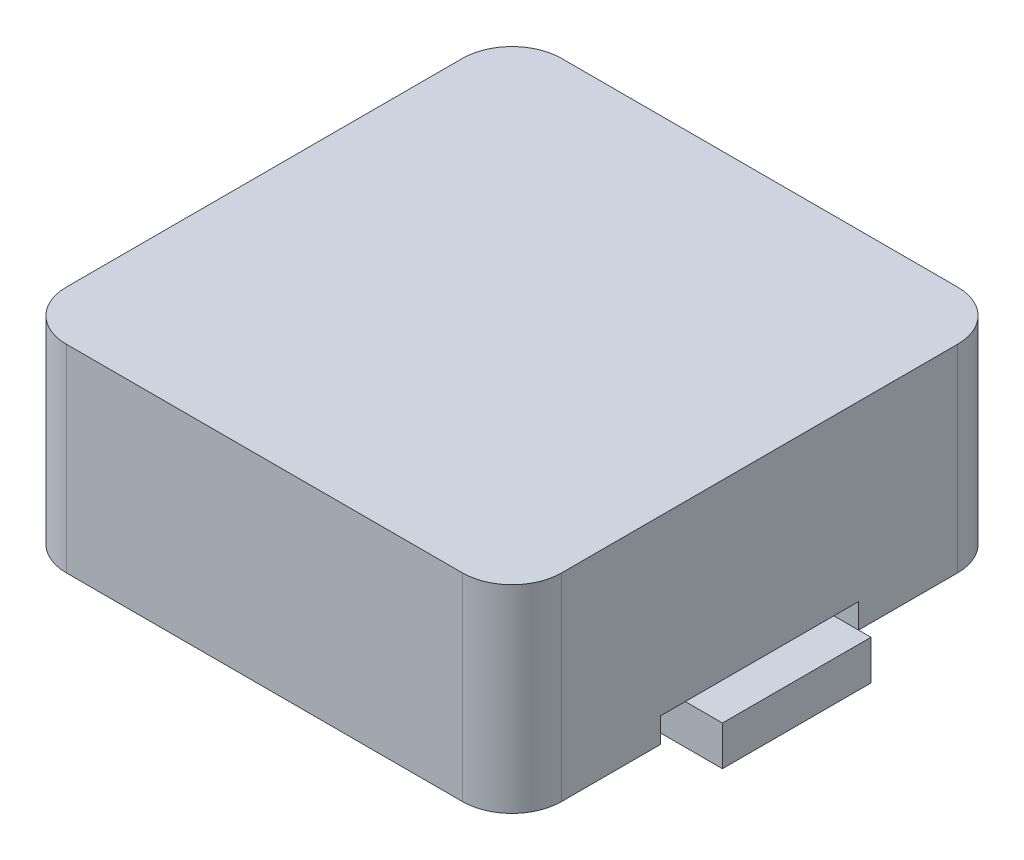
ISO-10303-21;
HEADER;
FILE_DESCRIPTION(('STEP AP214'),'2;1');
FILE_NAME('part.step','',(''),(''),'','','');
FILE_SCHEMA(('AUTOMOTIVE_DESIGN { 1 0 10303 214 1 1 1 1 }'));
ENDSEC;
DATA;
#1=APPLICATION_CONTEXT('core data for automotive mechanical design processes');
#2=APPLICATION_PROTOCOL_DEFINITION('international standard','automotive_design',2000,#1);
#3=PRODUCT_CONTEXT('',#1,'mechanical');
#4=PRODUCT('Part','Part','',(#3));
#5=PRODUCT_RELATED_PRODUCT_CATEGORY('part','',(#4));
#6=PRODUCT_DEFINITION_FORMATION('','',#4);
#7=PRODUCT_DEFINITION_CONTEXT('part definition',#1,'design');
#8=PRODUCT_DEFINITION('design','',#6,#7);
#9=PRODUCT_DEFINITION_SHAPE('','',#8);
#10=(LENGTH_UNIT() NAMED_UNIT(*) SI_UNIT(.MILLI.,.METRE.));
#11=(NAMED_UNIT(*) PLANE_ANGLE_UNIT() SI_UNIT($,.RADIAN.));
#12=(NAMED_UNIT(*) SI_UNIT($,.STERADIAN.) SOLID_ANGLE_UNIT());
#13=UNCERTAINTY_MEASURE_WITH_UNIT(LENGTH_MEASURE(1.E-05),#10,'distance_accuracy_value','');
#14=(GEOMETRIC_REPRESENTATION_CONTEXT(3) GLOBAL_UNCERTAINTY_ASSIGNED_CONTEXT((#13)) GLOBAL_UNIT_ASSIGNED_CONTEXT((#10,
#11,#12)) REPRESENTATION_CONTEXT('',''));
#15=CARTESIAN_POINT('',(0.,0.,0.));
#16=DIRECTION('',(0.,0.,1.));
#17=DIRECTION('',(1.,0.,0.));
#18=AXIS2_PLACEMENT_3D('',#15,#16,#17);
#19=CARTESIAN_POINT('',(4.,0.,-4.));
#20=DIRECTION('',(0.,-1.,0.));
#21=DIRECTION('',(0.,0.,-1.));
#22=AXIS2_PLACEMENT_3D('',#19,#20,#21);
#23=PLANE('',#22);
#24=DIRECTION('',(0.,0.,1.));
#25=VECTOR('',#24,1.);
#26=CARTESIAN_POINT('',(3.99367585960992,0.,-4.));
#27=LINE('',#26,#25);
#28=CARTESIAN_POINT('',(3.99367585960992,0.,-1.5));
#29=VERTEX_POINT('',#28);
#30=CARTESIAN_POINT('',(3.99367585960992,0.,1.5));
#31=VERTEX_POINT('',#30);
#32=EDGE_CURVE('E11',#29,#31,#27,.T.);
#33=ORIENTED_EDGE('',*,*,#32,.T.);
#34=DIRECTION('',(1.,0.,0.));
#35=VECTOR('',#34,1.);
#36=CARTESIAN_POINT('',(4.,0.,1.5));
#37=LINE('',#36,#35);
#38=CARTESIAN_POINT('',(4.,0.,1.5));
#39=VERTEX_POINT('',#38);
#40=EDGE_CURVE('E269',#31,#39,#37,.T.);
#41=ORIENTED_EDGE('',*,*,#40,.T.);
#42=DIRECTION('',(0.,0.,1.));
#43=VECTOR('',#42,1.);
#44=CARTESIAN_POINT('',(4.,0.,2.));
#45=LINE('',#44,#43);
#46=CARTESIAN_POINT('',(4.,0.,2.));
#47=VERTEX_POINT('',#46);
#48=EDGE_CURVE('E337',#39,#47,#45,.T.);
#49=ORIENTED_EDGE('',*,*,#48,.T.);
#50=DIRECTION('',(1.,0.,0.));
#51=VECTOR('',#50,1.);
#52=CARTESIAN_POINT('',(6.,0.,2.));
#53=LINE('',#52,#51);
#54=CARTESIAN_POINT('',(5.,0.,2.));
#55=VERTEX_POINT('',#54);
#56=EDGE_CURVE('E334',#47,#55,#53,.T.);
#57=ORIENTED_EDGE('',*,*,#56,.T.);
#58=DIRECTION('',(0.,0.,-1.));
#59=VECTOR('',#58,1.);
#60=CARTESIAN_POINT('',(5.,0.,3.99999999999999));
#61=LINE('',#60,#59);
#62=CARTESIAN_POINT('',(5.,0.,3.99999999999999));
#63=VERTEX_POINT('',#62);
#64=EDGE_CURVE('E362',#63,#55,#61,.T.);
#65=ORIENTED_EDGE('',*,*,#64,.F.);
#66=CARTESIAN_POINT('',(4.,0.,4.));
#67=DIRECTION('',(0.,1.,0.));
#68=DIRECTION('',(0.,0.,1.));
#69=AXIS2_PLACEMENT_3D('',#66,#67,#68);
#70=CIRCLE('',#69,1.);
#71=CARTESIAN_POINT('',(4.,0.,5.));
#72=VERTEX_POINT('',#71);
#73=EDGE_CURVE('E391',#72,#63,#70,.T.);
#74=ORIENTED_EDGE('',*,*,#73,.F.);
#75=DIRECTION('',(1.,0.,0.));
#76=VECTOR('',#75,1.);
#77=CARTESIAN_POINT('',(-3.99999999999999,0.,5.));
#78=LINE('',#77,#76);
#79=CARTESIAN_POINT('',(-3.99999999999999,0.,5.));
#80=VERTEX_POINT('',#79);
#81=EDGE_CURVE('E389',#80,#72,#78,.T.);
#82=ORIENTED_EDGE('',*,*,#81,.F.);
#83=CARTESIAN_POINT('',(-4.,0.,4.));
#84=DIRECTION('',(0.,1.,0.));
#85=DIRECTION('',(0.,0.,-1.));
#86=AXIS2_PLACEMENT_3D('',#83,#84,#85);
#87=CIRCLE('',#86,1.);
#88=CARTESIAN_POINT('',(-5.,0.,3.99999999999999));
#89=VERTEX_POINT('',#88);
#90=EDGE_CURVE('E387',#89,#80,#87,.T.);
#91=ORIENTED_EDGE('',*,*,#90,.F.);
#92=DIRECTION('',(0.,0.,1.));
#93=VECTOR('',#92,1.);
#94=CARTESIAN_POINT('',(-5.,0.,3.99999999999999));
#95=LINE('',#94,#93);
#96=CARTESIAN_POINT('',(-5.,0.,2.));
#97=VERTEX_POINT('',#96);
#98=EDGE_CURVE('E383',#97,#89,#95,.T.);
#99=ORIENTED_EDGE('',*,*,#98,.F.);
#100=DIRECTION('',(1.,0.,0.));
#101=VECTOR('',#100,1.);
#102=CARTESIAN_POINT('',(4.,0.,2.));
#103=LINE('',#102,#101);
#104=CARTESIAN_POINT('',(-4.,0.,2.));
#105=VERTEX_POINT('',#104);
#106=EDGE_CURVE('E422',#97,#105,#103,.T.);
#107=ORIENTED_EDGE('',*,*,#106,.T.);
#108=DIRECTION('',(0.,0.,-1.));
#109=VECTOR('',#108,1.);
#110=CARTESIAN_POINT('',(-4.,0.,2.));
#111=LINE('',#110,#109);
#112=CARTESIAN_POINT('',(-4.,0.,1.5));
#113=VERTEX_POINT('',#112);
#114=EDGE_CURVE('E315',#105,#113,#111,.T.);
#115=ORIENTED_EDGE('',*,*,#114,.T.);
#116=CARTESIAN_POINT('',(-4.,0.,-1.5));
#117=VERTEX_POINT('',#116);
#118=EDGE_CURVE('E319',#113,#117,#111,.T.);
#119=ORIENTED_EDGE('',*,*,#118,.T.);
#120=CARTESIAN_POINT('',(-4.,0.,-2.));
#121=VERTEX_POINT('',#120);
#122=EDGE_CURVE('E320',#117,#121,#111,.T.);
#123=ORIENTED_EDGE('',*,*,#122,.T.);
#124=DIRECTION('',(-1.,0.,0.));
#125=VECTOR('',#124,1.);
#126=CARTESIAN_POINT('',(-6.,0.,-2.));
#127=LINE('',#126,#125);
#128=CARTESIAN_POINT('',(-5.,0.,-2.));
#129=VERTEX_POINT('',#128);
#130=EDGE_CURVE('E318',#121,#129,#127,.T.);
#131=ORIENTED_EDGE('',*,*,#130,.T.);
#132=CARTESIAN_POINT('',(-5.,0.,-3.99999999999999));
#133=VERTEX_POINT('',#132);
#134=EDGE_CURVE('E384',#133,#129,#95,.T.);
#135=ORIENTED_EDGE('',*,*,#134,.F.);
#136=CARTESIAN_POINT('',(-4.,0.,-4.));
#137=DIRECTION('',(0.,1.,0.));
#138=DIRECTION('',(0.,0.,-1.));
#139=AXIS2_PLACEMENT_3D('',#136,#137,#138);
#140=CIRCLE('',#139,1.);
#141=CARTESIAN_POINT('',(-3.99999999999999,0.,-5.));
#142=VERTEX_POINT('',#141);
#143=EDGE_CURVE('E381',#142,#133,#140,.T.);
#144=ORIENTED_EDGE('',*,*,#143,.F.);
#145=DIRECTION('',(-1.,0.,0.));
#146=VECTOR('',#145,1.);
#147=CARTESIAN_POINT('',(-3.99999999999999,0.,-5.));
#148=LINE('',#147,#146);
#149=CARTESIAN_POINT('',(4.,0.,-5.));
#150=VERTEX_POINT('',#149);
#151=EDGE_CURVE('E379',#150,#142,#148,.T.);
#152=ORIENTED_EDGE('',*,*,#151,.F.);
#153=CARTESIAN_POINT('',(4.,0.,-4.));
#154=DIRECTION('',(0.,1.,0.));
#155=DIRECTION('',(0.,0.,-1.));
#156=AXIS2_PLACEMENT_3D('',#153,#154,#155);
#157=CIRCLE('',#156,1.);
#158=CARTESIAN_POINT('',(5.,0.,-3.99999999999999));
#159=VERTEX_POINT('',#158);
#160=EDGE_CURVE('E357',#159,#150,#157,.T.);
#161=ORIENTED_EDGE('',*,*,#160,.F.);
#162=CARTESIAN_POINT('',(5.,0.,-2.));
#163=VERTEX_POINT('',#162);
#164=EDGE_CURVE('E393',#163,#159,#61,.T.);
#165=ORIENTED_EDGE('',*,*,#164,.F.);
#166=DIRECTION('',(-1.,0.,0.));
#167=VECTOR('',#166,1.);
#168=CARTESIAN_POINT('',(4.,0.,-2.));
#169=LINE('',#168,#167);
#170=CARTESIAN_POINT('',(4.,0.,-2.));
#171=VERTEX_POINT('',#170);
#172=EDGE_CURVE('E419',#163,#171,#169,.T.);
#173=ORIENTED_EDGE('',*,*,#172,.T.);
#174=CARTESIAN_POINT('',(4.,0.,-1.5));
#175=VERTEX_POINT('',#174);
#176=EDGE_CURVE('E339',#171,#175,#45,.T.);
#177=ORIENTED_EDGE('',*,*,#176,.T.);
#178=DIRECTION('',(-1.,0.,0.));
#179=VECTOR('',#178,1.);
#180=CARTESIAN_POINT('',(4.,0.,-1.5));
#181=LINE('',#180,#179);
#182=EDGE_CURVE('E52',#175,#29,#181,.T.);
#183=ORIENTED_EDGE('',*,*,#182,.T.);
#184=EDGE_LOOP('',(#33,#41,#49,#57,#65,#74,#82,#91,#99,#107,#115,#119,#123,#131,#135,#144,#152,
#161,#165,#173,#177,#183));
#185=FACE_BOUND('',#184,.T.);
#186=ADVANCED_FACE('F37',(#185),#23,.T.);
#187=CARTESIAN_POINT('',(0.,0.5,0.));
#188=DIRECTION('',(0.,1.,0.));
#189=DIRECTION('',(0.,0.,1.));
#190=AXIS2_PLACEMENT_3D('',#187,#188,#189);
#191=PLANE('',#190);
#192=DIRECTION('',(-1.,0.,0.));
#193=VECTOR('',#192,1.);
#194=CARTESIAN_POINT('',(3.99367585960992,0.5,1.5));
#195=LINE('',#194,#193);
#196=CARTESIAN_POINT('',(5.,0.5,1.5));
#197=VERTEX_POINT('',#196);
#198=CARTESIAN_POINT('',(4.,0.5,1.5));
#199=VERTEX_POINT('',#198);
#200=EDGE_CURVE('E256',#197,#199,#195,.T.);
#201=ORIENTED_EDGE('',*,*,#200,.F.);
#202=DIRECTION('',(0.,0.,-1.));
#203=VECTOR('',#202,1.);
#204=CARTESIAN_POINT('',(5.,0.5,3.99999999999999));
#205=LINE('',#204,#203);
#206=CARTESIAN_POINT('',(5.,0.5,2.));
#207=VERTEX_POINT('',#206);
#208=EDGE_CURVE('E426',#207,#197,#205,.T.);
#209=ORIENTED_EDGE('',*,*,#208,.F.);
#210=DIRECTION('',(1.,0.,0.));
#211=VECTOR('',#210,1.);
#212=CARTESIAN_POINT('',(6.,0.5,2.));
#213=LINE('',#212,#211);
#214=CARTESIAN_POINT('',(4.,0.5,2.));
#215=VERTEX_POINT('',#214);
#216=EDGE_CURVE('E333',#215,#207,#213,.T.);
#217=ORIENTED_EDGE('',*,*,#216,.F.);
#218=DIRECTION('',(0.,0.,1.));
#219=VECTOR('',#218,1.);
#220=CARTESIAN_POINT('',(4.,0.5,2.));
#221=LINE('',#220,#219);
#222=EDGE_CURVE('E344',#199,#215,#221,.T.);
#223=ORIENTED_EDGE('',*,*,#222,.F.);
#224=EDGE_LOOP('',(#201,#209,#217,#223));
#225=FACE_BOUND('',#224,.T.);
#226=ADVANCED_FACE('F447',(#225),#191,.F.);
#227=DIRECTION('',(1.,0.,0.));
#228=VECTOR('',#227,1.);
#229=CARTESIAN_POINT('',(3.99367585960992,0.5,-1.5));
#230=LINE('',#229,#228);
#231=CARTESIAN_POINT('',(4.,0.5,-1.5));
#232=VERTEX_POINT('',#231);
#233=CARTESIAN_POINT('',(5.,0.5,-1.5));
#234=VERTEX_POINT('',#233);
#235=EDGE_CURVE('E259',#232,#234,#230,.T.);
#236=ORIENTED_EDGE('',*,*,#235,.F.);
#237=CARTESIAN_POINT('',(4.,0.5,-2.));
#238=VERTEX_POINT('',#237);
#239=EDGE_CURVE('E345',#238,#232,#221,.T.);
#240=ORIENTED_EDGE('',*,*,#239,.F.);
#241=DIRECTION('',(-1.,0.,0.));
#242=VECTOR('',#241,1.);
#243=CARTESIAN_POINT('',(6.,0.5,-2.));
#244=LINE('',#243,#242);
#245=CARTESIAN_POINT('',(5.,0.5,-2.));
#246=VERTEX_POINT('',#245);
#247=EDGE_CURVE('E338',#246,#238,#244,.T.);
#248=ORIENTED_EDGE('',*,*,#247,.F.);
#249=EDGE_CURVE('E425',#234,#246,#205,.T.);
#250=ORIENTED_EDGE('',*,*,#249,.F.);
#251=EDGE_LOOP('',(#236,#240,#248,#250));
#252=FACE_BOUND('',#251,.T.);
#253=ADVANCED_FACE('F482',(#252),#191,.F.);
#254=CARTESIAN_POINT('',(4.,0.5,2.));
#255=DIRECTION('',(1.,0.,0.));
#256=DIRECTION('',(0.,0.,-1.));
#257=AXIS2_PLACEMENT_3D('',#254,#255,#256);
#258=PLANE('',#257);
#259=ORIENTED_EDGE('',*,*,#48,.F.);
#260=DIRECTION('',(0.,1.,0.));
#261=VECTOR('',#260,1.);
#262=CARTESIAN_POINT('',(4.,0.5,1.5));
#263=LINE('',#262,#261);
#264=EDGE_CURVE('E45',#39,#199,#263,.T.);
#265=ORIENTED_EDGE('',*,*,#264,.T.);
#266=ORIENTED_EDGE('',*,*,#222,.T.);
#267=DIRECTION('',(0.,-1.,0.));
#268=VECTOR('',#267,1.);
#269=CARTESIAN_POINT('',(4.,0.5,2.));
#270=LINE('',#269,#268);
#271=EDGE_CURVE('E330',#215,#47,#270,.T.);
#272=ORIENTED_EDGE('',*,*,#271,.T.);
#273=EDGE_LOOP('',(#259,#265,#266,#272));
#274=FACE_BOUND('',#273,.T.);
#275=ADVANCED_FACE('F443',(#274),#258,.T.);
#276=ORIENTED_EDGE('',*,*,#239,.T.);
#277=DIRECTION('',(0.,-1.,0.));
#278=VECTOR('',#277,1.);
#279=CARTESIAN_POINT('',(4.,0.5,-1.5));
#280=LINE('',#279,#278);
#281=EDGE_CURVE('E438',#232,#175,#280,.T.);
#282=ORIENTED_EDGE('',*,*,#281,.T.);
#283=ORIENTED_EDGE('',*,*,#176,.F.);
#284=DIRECTION('',(0.,-1.,0.));
#285=VECTOR('',#284,1.);
#286=CARTESIAN_POINT('',(4.,0.5,-2.));
#287=LINE('',#286,#285);
#288=EDGE_CURVE('E304',#238,#171,#287,.T.);
#289=ORIENTED_EDGE('',*,*,#288,.F.);
#290=EDGE_LOOP('',(#276,#282,#283,#289));
#291=FACE_BOUND('',#290,.T.);
#292=ADVANCED_FACE('F476',(#291),#258,.T.);
#293=CARTESIAN_POINT('',(0.,0.5,0.));
#294=DIRECTION('',(0.,-1.,0.));
#295=DIRECTION('',(0.,0.,-1.));
#296=AXIS2_PLACEMENT_3D('',#293,#294,#295);
#297=PLANE('',#296);
#298=DIRECTION('',(0.,0.,-1.));
#299=VECTOR('',#298,1.);
#300=CARTESIAN_POINT('',(-5.,0.5,3.99999999999999));
#301=LINE('',#300,#299);
#302=CARTESIAN_POINT('',(-5.,0.5,2.));
#303=VERTEX_POINT('',#302);
#304=CARTESIAN_POINT('',(-5.,0.5,1.5));
#305=VERTEX_POINT('',#304);
#306=EDGE_CURVE('E430',#303,#305,#301,.T.);
#307=ORIENTED_EDGE('',*,*,#306,.T.);
#308=DIRECTION('',(-1.,0.,0.));
#309=VECTOR('',#308,1.);
#310=CARTESIAN_POINT('',(-5.75,0.5,1.5));
#311=LINE('',#310,#309);
#312=CARTESIAN_POINT('',(-4.,0.5,1.5));
#313=VERTEX_POINT('',#312);
#314=EDGE_CURVE('E284',#313,#305,#311,.T.);
#315=ORIENTED_EDGE('',*,*,#314,.F.);
#316=DIRECTION('',(0.,0.,-1.));
#317=VECTOR('',#316,1.);
#318=CARTESIAN_POINT('',(-4.,0.5,2.));
#319=LINE('',#318,#317);
#320=CARTESIAN_POINT('',(-4.,0.5,2.));
#321=VERTEX_POINT('',#320);
#322=EDGE_CURVE('E305',#321,#313,#319,.T.);
#323=ORIENTED_EDGE('',*,*,#322,.F.);
#324=DIRECTION('',(1.,0.,0.));
#325=VECTOR('',#324,1.);
#326=CARTESIAN_POINT('',(-6.,0.5,2.));
#327=LINE('',#326,#325);
#328=EDGE_CURVE('E312',#303,#321,#327,.T.);
#329=ORIENTED_EDGE('',*,*,#328,.F.);
#330=EDGE_LOOP('',(#307,#315,#323,#329));
#331=FACE_BOUND('',#330,.T.);
#332=ADVANCED_FACE('F568',(#331),#297,.T.);
#333=CARTESIAN_POINT('',(-4.,0.5,-1.5));
#334=VERTEX_POINT('',#333);
#335=CARTESIAN_POINT('',(-4.,0.5,-2.));
#336=VERTEX_POINT('',#335);
#337=EDGE_CURVE('E309',#334,#336,#319,.T.);
#338=ORIENTED_EDGE('',*,*,#337,.F.);
#339=DIRECTION('',(1.,0.,0.));
#340=VECTOR('',#339,1.);
#341=CARTESIAN_POINT('',(-5.75,0.5,-1.5));
#342=LINE('',#341,#340);
#343=CARTESIAN_POINT('',(-5.,0.5,-1.5));
#344=VERTEX_POINT('',#343);
#345=EDGE_CURVE('E60',#344,#334,#342,.T.);
#346=ORIENTED_EDGE('',*,*,#345,.F.);
#347=CARTESIAN_POINT('',(-5.,0.5,-2.));
#348=VERTEX_POINT('',#347);
#349=EDGE_CURVE('E429',#344,#348,#301,.T.);
#350=ORIENTED_EDGE('',*,*,#349,.T.);
#351=DIRECTION('',(-1.,0.,0.));
#352=VECTOR('',#351,1.);
#353=CARTESIAN_POINT('',(-6.,0.5,-2.));
#354=LINE('',#353,#352);
#355=EDGE_CURVE('E308',#336,#348,#354,.T.);
#356=ORIENTED_EDGE('',*,*,#355,.F.);
#357=EDGE_LOOP('',(#338,#346,#350,#356));
#358=FACE_BOUND('',#357,.T.);
#359=ADVANCED_FACE('F687',(#358),#297,.T.);
#360=CARTESIAN_POINT('',(-4.,0.5,2.));
#361=DIRECTION('',(-1.,0.,0.));
#362=DIRECTION('',(0.,0.,1.));
#363=AXIS2_PLACEMENT_3D('',#360,#361,#362);
#364=PLANE('',#363);
#365=ORIENTED_EDGE('',*,*,#322,.T.);
#366=DIRECTION('',(0.,-1.,0.));
#367=VECTOR('',#366,1.);
#368=CARTESIAN_POINT('',(-4.,0.5,1.5));
#369=LINE('',#368,#367);
#370=EDGE_CURVE('E435',#313,#113,#369,.T.);
#371=ORIENTED_EDGE('',*,*,#370,.T.);
#372=ORIENTED_EDGE('',*,*,#114,.F.);
#373=DIRECTION('',(0.,-1.,0.));
#374=VECTOR('',#373,1.);
#375=CARTESIAN_POINT('',(-4.,0.5,2.));
#376=LINE('',#375,#374);
#377=EDGE_CURVE('E314',#321,#105,#376,.T.);
#378=ORIENTED_EDGE('',*,*,#377,.F.);
#379=EDGE_LOOP('',(#365,#371,#372,#378));
#380=FACE_BOUND('',#379,.T.);
#381=ADVANCED_FACE('F561',(#380),#364,.T.);
#382=ORIENTED_EDGE('',*,*,#122,.F.);
#383=DIRECTION('',(0.,1.,0.));
#384=VECTOR('',#383,1.);
#385=CARTESIAN_POINT('',(-4.,0.5,-1.5));
#386=LINE('',#385,#384);
#387=EDGE_CURVE('E433',#117,#334,#386,.T.);
#388=ORIENTED_EDGE('',*,*,#387,.T.);
#389=ORIENTED_EDGE('',*,*,#337,.T.);
#390=DIRECTION('',(0.,-1.,0.));
#391=VECTOR('',#390,1.);
#392=CARTESIAN_POINT('',(-4.,0.5,-2.));
#393=LINE('',#392,#391);
#394=EDGE_CURVE('E325',#336,#121,#393,.T.);
#395=ORIENTED_EDGE('',*,*,#394,.T.);
#396=EDGE_LOOP('',(#382,#388,#389,#395));
#397=FACE_BOUND('',#396,.T.);
#398=ADVANCED_FACE('F521',(#397),#364,.T.);
#399=CARTESIAN_POINT('',(-5.,4.,3.99999999999999));
#400=DIRECTION('',(1.,0.,0.));
#401=DIRECTION('',(0.,0.,-1.));
#402=AXIS2_PLACEMENT_3D('',#399,#400,#401);
#403=PLANE('',#402);
#404=DIRECTION('',(0.,-1.,0.));
#405=VECTOR('',#404,1.);
#406=CARTESIAN_POINT('',(-5.,4.,-2.));
#407=LINE('',#406,#405);
#408=EDGE_CURVE('E355',#348,#129,#407,.T.);
#409=ORIENTED_EDGE('',*,*,#408,.F.);
#410=ORIENTED_EDGE('',*,*,#349,.F.);
#411=DIRECTION('',(0.,0.,1.));
#412=VECTOR('',#411,1.);
#413=CARTESIAN_POINT('',(-5.,0.5,3.99999999999999));
#414=LINE('',#413,#412);
#415=EDGE_CURVE('E301',#344,#305,#414,.T.);
#416=ORIENTED_EDGE('',*,*,#415,.T.);
#417=ORIENTED_EDGE('',*,*,#306,.F.);
#418=DIRECTION('',(0.,1.,0.));
#419=VECTOR('',#418,1.);
#420=CARTESIAN_POINT('',(-5.,4.,2.));
#421=LINE('',#420,#419);
#422=EDGE_CURVE('E353',#97,#303,#421,.T.);
#423=ORIENTED_EDGE('',*,*,#422,.F.);
#424=ORIENTED_EDGE('',*,*,#98,.T.);
#425=DIRECTION('',(0.,-1.,0.));
#426=VECTOR('',#425,1.);
#427=CARTESIAN_POINT('',(-5.,4.,3.99999999999999));
#428=LINE('',#427,#426);
#429=CARTESIAN_POINT('',(-5.,4.,3.99999999999999));
#430=VERTEX_POINT('',#429);
#431=EDGE_CURVE('E407',#430,#89,#428,.T.);
#432=ORIENTED_EDGE('',*,*,#431,.F.);
#433=DIRECTION('',(0.,0.,1.));
#434=VECTOR('',#433,1.);
#435=CARTESIAN_POINT('',(-5.,4.,3.99999999999999));
#436=LINE('',#435,#434);
#437=CARTESIAN_POINT('',(-5.,4.,-3.99999999999999));
#438=VERTEX_POINT('',#437);
#439=EDGE_CURVE('E366',#438,#430,#436,.T.);
#440=ORIENTED_EDGE('',*,*,#439,.F.);
#441=DIRECTION('',(0.,-1.,0.));
#442=VECTOR('',#441,1.);
#443=CARTESIAN_POINT('',(-5.,4.,-3.99999999999999));
#444=LINE('',#443,#442);
#445=EDGE_CURVE('E410',#438,#133,#444,.T.);
#446=ORIENTED_EDGE('',*,*,#445,.T.);
#447=ORIENTED_EDGE('',*,*,#134,.T.);
#448=EDGE_LOOP('',(#409,#410,#416,#417,#423,#424,#432,#440,#446,#447));
#449=FACE_BOUND('',#448,.T.);
#450=ADVANCED_FACE('F505',(#449),#403,.F.);
#451=CARTESIAN_POINT('',(5.,4.,3.99999999999999));
#452=DIRECTION('',(-1.,0.,0.));
#453=DIRECTION('',(0.,0.,1.));
#454=AXIS2_PLACEMENT_3D('',#451,#452,#453);
#455=PLANE('',#454);
#456=DIRECTION('',(0.,1.,0.));
#457=VECTOR('',#456,1.);
#458=CARTESIAN_POINT('',(5.,4.,-2.));
#459=LINE('',#458,#457);
#460=EDGE_CURVE('E350',#163,#246,#459,.T.);
#461=ORIENTED_EDGE('',*,*,#460,.F.);
#462=ORIENTED_EDGE('',*,*,#164,.T.);
#463=DIRECTION('',(0.,-1.,0.));
#464=VECTOR('',#463,1.);
#465=CARTESIAN_POINT('',(5.,4.,-3.99999999999999));
#466=LINE('',#465,#464);
#467=CARTESIAN_POINT('',(5.,4.,-3.99999999999999));
#468=VERTEX_POINT('',#467);
#469=EDGE_CURVE('E376',#468,#159,#466,.T.);
#470=ORIENTED_EDGE('',*,*,#469,.F.);
#471=DIRECTION('',(0.,0.,-1.));
#472=VECTOR('',#471,1.);
#473=CARTESIAN_POINT('',(5.,4.,3.99999999999999));
#474=LINE('',#473,#472);
#475=CARTESIAN_POINT('',(5.,4.,3.99999999999999));
#476=VERTEX_POINT('',#475);
#477=EDGE_CURVE('E374',#476,#468,#474,.T.);
#478=ORIENTED_EDGE('',*,*,#477,.F.);
#479=DIRECTION('',(0.,-1.,0.));
#480=VECTOR('',#479,1.);
#481=CARTESIAN_POINT('',(5.,4.,3.99999999999999));
#482=LINE('',#481,#480);
#483=EDGE_CURVE('E398',#476,#63,#482,.T.);
#484=ORIENTED_EDGE('',*,*,#483,.T.);
#485=ORIENTED_EDGE('',*,*,#64,.T.);
#486=DIRECTION('',(0.,-1.,0.));
#487=VECTOR('',#486,1.);
#488=CARTESIAN_POINT('',(5.,4.,2.));
#489=LINE('',#488,#487);
#490=EDGE_CURVE('E328',#207,#55,#489,.T.);
#491=ORIENTED_EDGE('',*,*,#490,.F.);
#492=ORIENTED_EDGE('',*,*,#208,.T.);
#493=DIRECTION('',(0.,0.,1.));
#494=VECTOR('',#493,1.);
#495=CARTESIAN_POINT('',(5.,0.5,3.99999999999999));
#496=LINE('',#495,#494);
#497=EDGE_CURVE('E255',#234,#197,#496,.T.);
#498=ORIENTED_EDGE('',*,*,#497,.F.);
#499=ORIENTED_EDGE('',*,*,#249,.T.);
#500=EDGE_LOOP('',(#461,#462,#470,#478,#484,#485,#491,#492,#498,#499));
#501=FACE_BOUND('',#500,.T.);
#502=ADVANCED_FACE('F454',(#501),#455,.F.);
#503=CARTESIAN_POINT('',(4.,4.,-4.));
#504=DIRECTION('',(0.,-1.,0.));
#505=DIRECTION('',(0.,0.,-1.));
#506=AXIS2_PLACEMENT_3D('',#503,#504,#505);
#507=CYLINDRICAL_SURFACE('',#506,1.);
#508=ORIENTED_EDGE('',*,*,#160,.T.);
#509=DIRECTION('',(0.,-1.,0.));
#510=VECTOR('',#509,1.);
#511=CARTESIAN_POINT('',(4.,4.,-5.));
#512=LINE('',#511,#510);
#513=CARTESIAN_POINT('',(4.,4.,-5.));
#514=VERTEX_POINT('',#513);
#515=EDGE_CURVE('E416',#514,#150,#512,.T.);
#516=ORIENTED_EDGE('',*,*,#515,.F.);
#517=CARTESIAN_POINT('',(4.,4.,-4.));
#518=DIRECTION('',(0.,1.,0.));
#519=DIRECTION('',(0.,0.,-1.));
#520=AXIS2_PLACEMENT_3D('',#517,#518,#519);
#521=CIRCLE('',#520,1.);
#522=EDGE_CURVE('E358',#468,#514,#521,.T.);
#523=ORIENTED_EDGE('',*,*,#522,.F.);
#524=ORIENTED_EDGE('',*,*,#469,.T.);
#525=EDGE_LOOP('',(#508,#516,#523,#524));
#526=FACE_BOUND('',#525,.T.);
#527=ADVANCED_FACE('F39',(#526),#507,.T.);
#528=CARTESIAN_POINT('',(-3.99999999999999,4.,-5.));
#529=DIRECTION('',(0.,0.,1.));
#530=DIRECTION('',(1.,0.,0.));
#531=AXIS2_PLACEMENT_3D('',#528,#529,#530);
#532=PLANE('',#531);
#533=ORIENTED_EDGE('',*,*,#151,.T.);
#534=DIRECTION('',(0.,-1.,0.));
#535=VECTOR('',#534,1.);
#536=CARTESIAN_POINT('',(-3.99999999999999,4.,-5.));
#537=LINE('',#536,#535);
#538=CARTESIAN_POINT('',(-3.99999999999999,4.,-5.));
#539=VERTEX_POINT('',#538);
#540=EDGE_CURVE('E413',#539,#142,#537,.T.);
#541=ORIENTED_EDGE('',*,*,#540,.F.);
#542=DIRECTION('',(-1.,0.,0.));
#543=VECTOR('',#542,1.);
#544=CARTESIAN_POINT('',(-3.99999999999999,4.,-5.));
#545=LINE('',#544,#543);
#546=EDGE_CURVE('E361',#514,#539,#545,.T.);
#547=ORIENTED_EDGE('',*,*,#546,.F.);
#548=ORIENTED_EDGE('',*,*,#515,.T.);
#549=EDGE_LOOP('',(#533,#541,#547,#548));
#550=FACE_BOUND('',#549,.T.);
#551=ADVANCED_FACE('F524',(#550),#532,.F.);
#552=CARTESIAN_POINT('',(-4.,4.,-4.));
#553=DIRECTION('',(0.,-1.,0.));
#554=DIRECTION('',(0.,0.,-1.));
#555=AXIS2_PLACEMENT_3D('',#552,#553,#554);
#556=CYLINDRICAL_SURFACE('',#555,1.);
#557=ORIENTED_EDGE('',*,*,#143,.T.);
#558=ORIENTED_EDGE('',*,*,#445,.F.);
#559=CARTESIAN_POINT('',(-4.,4.,-4.));
#560=DIRECTION('',(0.,1.,0.));
#561=DIRECTION('',(0.,0.,-1.));
#562=AXIS2_PLACEMENT_3D('',#559,#560,#561);
#563=CIRCLE('',#562,1.);
#564=EDGE_CURVE('E364',#539,#438,#563,.T.);
#565=ORIENTED_EDGE('',*,*,#564,.F.);
#566=ORIENTED_EDGE('',*,*,#540,.T.);
#567=EDGE_LOOP('',(#557,#558,#565,#566));
#568=FACE_BOUND('',#567,.T.);
#569=ADVANCED_FACE('F517',(#568),#556,.T.);
#570=CARTESIAN_POINT('',(-4.,4.,4.));
#571=DIRECTION('',(0.,-1.,0.));
#572=DIRECTION('',(0.,0.,-1.));
#573=AXIS2_PLACEMENT_3D('',#570,#571,#572);
#574=CYLINDRICAL_SURFACE('',#573,1.);
#575=ORIENTED_EDGE('',*,*,#90,.T.);
#576=DIRECTION('',(0.,-1.,0.));
#577=VECTOR('',#576,1.);
#578=CARTESIAN_POINT('',(-3.99999999999999,4.,5.));
#579=LINE('',#578,#577);
#580=CARTESIAN_POINT('',(-3.99999999999999,4.,5.));
#581=VERTEX_POINT('',#580);
#582=EDGE_CURVE('E404',#581,#80,#579,.T.);
#583=ORIENTED_EDGE('',*,*,#582,.F.);
#584=CARTESIAN_POINT('',(-4.,4.,4.));
#585=DIRECTION('',(0.,1.,0.));
#586=DIRECTION('',(0.,0.,-1.));
#587=AXIS2_PLACEMENT_3D('',#584,#585,#586);
#588=CIRCLE('',#587,1.);
#589=EDGE_CURVE('E368',#430,#581,#588,.T.);
#590=ORIENTED_EDGE('',*,*,#589,.F.);
#591=ORIENTED_EDGE('',*,*,#431,.T.);
#592=EDGE_LOOP('',(#575,#583,#590,#591));
#593=FACE_BOUND('',#592,.T.);
#594=ADVANCED_FACE('F513',(#593),#574,.T.);
#595=CARTESIAN_POINT('',(-3.99999999999999,4.,5.));
#596=DIRECTION('',(0.,0.,-1.));
#597=DIRECTION('',(-1.,0.,0.));
#598=AXIS2_PLACEMENT_3D('',#595,#596,#597);
#599=PLANE('',#598);
#600=ORIENTED_EDGE('',*,*,#81,.T.);
#601=DIRECTION('',(0.,-1.,0.));
#602=VECTOR('',#601,1.);
#603=CARTESIAN_POINT('',(4.,4.,5.));
#604=LINE('',#603,#602);
#605=CARTESIAN_POINT('',(4.,4.,5.));
#606=VERTEX_POINT('',#605);
#607=EDGE_CURVE('E401',#606,#72,#604,.T.);
#608=ORIENTED_EDGE('',*,*,#607,.F.);
#609=DIRECTION('',(1.,0.,0.));
#610=VECTOR('',#609,1.);
#611=CARTESIAN_POINT('',(-3.99999999999999,4.,5.));
#612=LINE('',#611,#610);
#613=EDGE_CURVE('E370',#581,#606,#612,.T.);
#614=ORIENTED_EDGE('',*,*,#613,.F.);
#615=ORIENTED_EDGE('',*,*,#582,.T.);
#616=EDGE_LOOP('',(#600,#608,#614,#615));
#617=FACE_BOUND('',#616,.T.);
#618=ADVANCED_FACE('F509',(#617),#599,.F.);
#619=CARTESIAN_POINT('',(4.,4.,4.));
#620=DIRECTION('',(0.,-1.,0.));
#621=DIRECTION('',(0.,0.,-1.));
#622=AXIS2_PLACEMENT_3D('',#619,#620,#621);
#623=CYLINDRICAL_SURFACE('',#622,1.);
#624=ORIENTED_EDGE('',*,*,#73,.T.);
#625=ORIENTED_EDGE('',*,*,#483,.F.);
#626=CARTESIAN_POINT('',(4.,4.,4.));
#627=DIRECTION('',(0.,1.,0.));
#628=DIRECTION('',(0.,0.,1.));
#629=AXIS2_PLACEMENT_3D('',#626,#627,#628);
#630=CIRCLE('',#629,1.);
#631=EDGE_CURVE('E372',#606,#476,#630,.T.);
#632=ORIENTED_EDGE('',*,*,#631,.F.);
#633=ORIENTED_EDGE('',*,*,#607,.T.);
#634=EDGE_LOOP('',(#624,#625,#632,#633));
#635=FACE_BOUND('',#634,.T.);
#636=ADVANCED_FACE('F506',(#635),#623,.T.);
#637=CARTESIAN_POINT('',(4.,4.,-4.));
#638=DIRECTION('',(0.,-1.,0.));
#639=DIRECTION('',(0.,0.,-1.));
#640=AXIS2_PLACEMENT_3D('',#637,#638,#639);
#641=PLANE('',#640);
#642=ORIENTED_EDGE('',*,*,#522,.T.);
#643=ORIENTED_EDGE('',*,*,#546,.T.);
#644=ORIENTED_EDGE('',*,*,#564,.T.);
#645=ORIENTED_EDGE('',*,*,#439,.T.);
#646=ORIENTED_EDGE('',*,*,#589,.T.);
#647=ORIENTED_EDGE('',*,*,#613,.T.);
#648=ORIENTED_EDGE('',*,*,#631,.T.);
#649=ORIENTED_EDGE('',*,*,#477,.T.);
#650=EDGE_LOOP('',(#642,#643,#644,#645,#646,#647,#648,#649));
#651=FACE_BOUND('',#650,.T.);
#652=ADVANCED_FACE('F502',(#651),#641,.F.);
#653=CARTESIAN_POINT('',(6.,0.5,-2.));
#654=DIRECTION('',(0.,0.,1.));
#655=DIRECTION('',(1.,0.,0.));
#656=AXIS2_PLACEMENT_3D('',#653,#654,#655);
#657=PLANE('',#656);
#658=ORIENTED_EDGE('',*,*,#460,.T.);
#659=ORIENTED_EDGE('',*,*,#247,.T.);
#660=ORIENTED_EDGE('',*,*,#288,.T.);
#661=ORIENTED_EDGE('',*,*,#172,.F.);
#662=EDGE_LOOP('',(#658,#659,#660,#661));
#663=FACE_BOUND('',#662,.T.);
#664=ADVANCED_FACE('F550',(#663),#657,.T.);
#665=CARTESIAN_POINT('',(6.,0.5,2.));
#666=DIRECTION('',(0.,0.,-1.));
#667=DIRECTION('',(-1.,0.,0.));
#668=AXIS2_PLACEMENT_3D('',#665,#666,#667);
#669=PLANE('',#668);
#670=ORIENTED_EDGE('',*,*,#490,.T.);
#671=ORIENTED_EDGE('',*,*,#56,.F.);
#672=ORIENTED_EDGE('',*,*,#271,.F.);
#673=ORIENTED_EDGE('',*,*,#216,.T.);
#674=EDGE_LOOP('',(#670,#671,#672,#673));
#675=FACE_BOUND('',#674,.T.);
#676=ADVANCED_FACE('F450',(#675),#669,.T.);
#677=CARTESIAN_POINT('',(-6.,0.5,-2.));
#678=DIRECTION('',(0.,0.,1.));
#679=DIRECTION('',(1.,0.,0.));
#680=AXIS2_PLACEMENT_3D('',#677,#678,#679);
#681=PLANE('',#680);
#682=ORIENTED_EDGE('',*,*,#408,.T.);
#683=ORIENTED_EDGE('',*,*,#130,.F.);
#684=ORIENTED_EDGE('',*,*,#394,.F.);
#685=ORIENTED_EDGE('',*,*,#355,.T.);
#686=EDGE_LOOP('',(#682,#683,#684,#685));
#687=FACE_BOUND('',#686,.T.);
#688=ADVANCED_FACE('F557',(#687),#681,.T.);
#689=CARTESIAN_POINT('',(-6.,0.5,2.));
#690=DIRECTION('',(0.,0.,-1.));
#691=DIRECTION('',(-1.,0.,0.));
#692=AXIS2_PLACEMENT_3D('',#689,#690,#691);
#693=PLANE('',#692);
#694=ORIENTED_EDGE('',*,*,#422,.T.);
#695=ORIENTED_EDGE('',*,*,#328,.T.);
#696=ORIENTED_EDGE('',*,*,#377,.T.);
#697=ORIENTED_EDGE('',*,*,#106,.F.);
#698=EDGE_LOOP('',(#694,#695,#696,#697));
#699=FACE_BOUND('',#698,.T.);
#700=ADVANCED_FACE('F585',(#699),#693,.T.);
#701=CARTESIAN_POINT('',(0.,0.5,0.));
#702=DIRECTION('',(0.,1.,0.));
#703=DIRECTION('',(0.,0.,1.));
#704=AXIS2_PLACEMENT_3D('',#701,#702,#703);
#705=PLANE('',#704);
#706=ORIENTED_EDGE('',*,*,#415,.F.);
#707=CARTESIAN_POINT('',(-5.75,0.5,-1.5));
#708=VERTEX_POINT('',#707);
#709=EDGE_CURVE('E277',#708,#344,#342,.T.);
#710=ORIENTED_EDGE('',*,*,#709,.F.);
#711=DIRECTION('',(0.,0.,-1.));
#712=VECTOR('',#711,1.);
#713=CARTESIAN_POINT('',(-5.75,0.5,-1.5));
#714=LINE('',#713,#712);
#715=CARTESIAN_POINT('',(-5.75,0.5,1.5));
#716=VERTEX_POINT('',#715);
#717=EDGE_CURVE('E287',#716,#708,#714,.T.);
#718=ORIENTED_EDGE('',*,*,#717,.F.);
#719=EDGE_CURVE('E272',#305,#716,#311,.T.);
#720=ORIENTED_EDGE('',*,*,#719,.F.);
#721=EDGE_LOOP('',(#706,#710,#718,#720));
#722=FACE_BOUND('',#721,.T.);
#723=ADVANCED_FACE('F590',(#722),#705,.T.);
#724=CARTESIAN_POINT('',(-5.75,-0.3,1.5));
#725=DIRECTION('',(0.,0.,-1.));
#726=DIRECTION('',(-1.,0.,0.));
#727=AXIS2_PLACEMENT_3D('',#724,#725,#726);
#728=PLANE('',#727);
#729=ORIENTED_EDGE('',*,*,#314,.T.);
#730=ORIENTED_EDGE('',*,*,#719,.T.);
#731=DIRECTION('',(0.,1.,0.));
#732=VECTOR('',#731,1.);
#733=CARTESIAN_POINT('',(-5.75,-0.3,1.5));
#734=LINE('',#733,#732);
#735=CARTESIAN_POINT('',(-5.75,-0.3,1.5));
#736=VERTEX_POINT('',#735);
#737=EDGE_CURVE('E298',#736,#716,#734,.T.);
#738=ORIENTED_EDGE('',*,*,#737,.F.);
#739=DIRECTION('',(-1.,0.,0.));
#740=VECTOR('',#739,1.);
#741=CARTESIAN_POINT('',(-5.75,-0.3,1.5));
#742=LINE('',#741,#740);
#743=CARTESIAN_POINT('',(-4.,-0.3,1.5));
#744=VERTEX_POINT('',#743);
#745=EDGE_CURVE('E273',#744,#736,#742,.T.);
#746=ORIENTED_EDGE('',*,*,#745,.F.);
#747=DIRECTION('',(0.,1.,0.));
#748=VECTOR('',#747,1.);
#749=CARTESIAN_POINT('',(-4.,-0.3,1.5));
#750=LINE('',#749,#748);
#751=EDGE_CURVE('E283',#744,#113,#750,.T.);
#752=ORIENTED_EDGE('',*,*,#751,.T.);
#753=ORIENTED_EDGE('',*,*,#370,.F.);
#754=EDGE_LOOP('',(#729,#730,#738,#746,#752,#753));
#755=FACE_BOUND('',#754,.T.);
#756=ADVANCED_FACE('F727',(#755),#728,.F.);
#757=CARTESIAN_POINT('',(-5.75,-0.3,-1.5));
#758=DIRECTION('',(1.,0.,0.));
#759=DIRECTION('',(0.,0.,-1.));
#760=AXIS2_PLACEMENT_3D('',#757,#758,#759);
#761=PLANE('',#760);
#762=ORIENTED_EDGE('',*,*,#717,.T.);
#763=DIRECTION('',(0.,1.,0.));
#764=VECTOR('',#763,1.);
#765=CARTESIAN_POINT('',(-5.75,-0.3,-1.5));
#766=LINE('',#765,#764);
#767=CARTESIAN_POINT('',(-5.75,-0.3,-1.5));
#768=VERTEX_POINT('',#767);
#769=EDGE_CURVE('E295',#768,#708,#766,.T.);
#770=ORIENTED_EDGE('',*,*,#769,.F.);
#771=DIRECTION('',(0.,0.,-1.));
#772=VECTOR('',#771,1.);
#773=CARTESIAN_POINT('',(-5.75,-0.3,-1.5));
#774=LINE('',#773,#772);
#775=EDGE_CURVE('E276',#736,#768,#774,.T.);
#776=ORIENTED_EDGE('',*,*,#775,.F.);
#777=ORIENTED_EDGE('',*,*,#737,.T.);
#778=EDGE_LOOP('',(#762,#770,#776,#777));
#779=FACE_BOUND('',#778,.T.);
#780=ADVANCED_FACE('F738',(#779),#761,.F.);
#781=CARTESIAN_POINT('',(-5.75,-0.3,-1.5));
#782=DIRECTION('',(0.,0.,1.));
#783=DIRECTION('',(1.,0.,0.));
#784=AXIS2_PLACEMENT_3D('',#781,#782,#783);
#785=PLANE('',#784);
#786=ORIENTED_EDGE('',*,*,#709,.T.);
#787=ORIENTED_EDGE('',*,*,#345,.T.);
#788=ORIENTED_EDGE('',*,*,#387,.F.);
#789=DIRECTION('',(0.,1.,0.));
#790=VECTOR('',#789,1.);
#791=CARTESIAN_POINT('',(-4.,-0.3,-1.5));
#792=LINE('',#791,#790);
#793=CARTESIAN_POINT('',(-4.,-0.3,-1.5));
#794=VERTEX_POINT('',#793);
#795=EDGE_CURVE('E292',#794,#117,#792,.T.);
#796=ORIENTED_EDGE('',*,*,#795,.F.);
#797=DIRECTION('',(1.,0.,0.));
#798=VECTOR('',#797,1.);
#799=CARTESIAN_POINT('',(-5.75,-0.3,-1.5));
#800=LINE('',#799,#798);
#801=EDGE_CURVE('E279',#768,#794,#800,.T.);
#802=ORIENTED_EDGE('',*,*,#801,.F.);
#803=ORIENTED_EDGE('',*,*,#769,.T.);
#804=EDGE_LOOP('',(#786,#787,#788,#796,#802,#803));
#805=FACE_BOUND('',#804,.T.);
#806=ADVANCED_FACE('F749',(#805),#785,.F.);
#807=CARTESIAN_POINT('',(-4.,-0.3,1.5));
#808=DIRECTION('',(-1.,0.,0.));
#809=DIRECTION('',(0.,0.,1.));
#810=AXIS2_PLACEMENT_3D('',#807,#808,#809);
#811=PLANE('',#810);
#812=ORIENTED_EDGE('',*,*,#118,.F.);
#813=ORIENTED_EDGE('',*,*,#751,.F.);
#814=DIRECTION('',(0.,0.,1.));
#815=VECTOR('',#814,1.);
#816=CARTESIAN_POINT('',(-4.,-0.3,1.5));
#817=LINE('',#816,#815);
#818=EDGE_CURVE('E281',#794,#744,#817,.T.);
#819=ORIENTED_EDGE('',*,*,#818,.F.);
#820=ORIENTED_EDGE('',*,*,#795,.T.);
#821=EDGE_LOOP('',(#812,#813,#819,#820));
#822=FACE_BOUND('',#821,.T.);
#823=ADVANCED_FACE('F760',(#822),#811,.F.);
#824=CARTESIAN_POINT('',(0.,-0.3,0.));
#825=DIRECTION('',(0.,1.,0.));
#826=DIRECTION('',(0.,0.,1.));
#827=AXIS2_PLACEMENT_3D('',#824,#825,#826);
#828=PLANE('',#827);
#829=ORIENTED_EDGE('',*,*,#745,.T.);
#830=ORIENTED_EDGE('',*,*,#775,.T.);
#831=ORIENTED_EDGE('',*,*,#801,.T.);
#832=ORIENTED_EDGE('',*,*,#818,.T.);
#833=EDGE_LOOP('',(#829,#830,#831,#832));
#834=FACE_BOUND('',#833,.T.);
#835=ADVANCED_FACE('F770',(#834),#828,.F.);
#836=CARTESIAN_POINT('',(0.,0.5,0.));
#837=DIRECTION('',(0.,-1.,0.));
#838=DIRECTION('',(0.,0.,-1.));
#839=AXIS2_PLACEMENT_3D('',#836,#837,#838);
#840=PLANE('',#839);
#841=CARTESIAN_POINT('',(5.75,0.5,-1.5));
#842=VERTEX_POINT('',#841);
#843=EDGE_CURVE('E241',#234,#842,#230,.T.);
#844=ORIENTED_EDGE('',*,*,#843,.F.);
#845=ORIENTED_EDGE('',*,*,#497,.T.);
#846=CARTESIAN_POINT('',(5.75,0.5,1.5));
#847=VERTEX_POINT('',#846);
#848=EDGE_CURVE('E247',#847,#197,#195,.T.);
#849=ORIENTED_EDGE('',*,*,#848,.F.);
#850=DIRECTION('',(0.,0.,1.));
#851=VECTOR('',#850,1.);
#852=CARTESIAN_POINT('',(5.75,0.5,-1.5));
#853=LINE('',#852,#851);
#854=EDGE_CURVE('E231',#842,#847,#853,.T.);
#855=ORIENTED_EDGE('',*,*,#854,.F.);
#856=EDGE_LOOP('',(#844,#845,#849,#855));
#857=FACE_BOUND('',#856,.T.);
#858=ADVANCED_FACE('F253',(#857),#840,.F.);
#859=CARTESIAN_POINT('',(3.99367585960992,-0.3,1.5));
#860=DIRECTION('',(0.,0.,-1.));
#861=DIRECTION('',(-1.,0.,0.));
#862=AXIS2_PLACEMENT_3D('',#859,#860,#861);
#863=PLANE('',#862);
#864=ORIENTED_EDGE('',*,*,#40,.F.);
#865=DIRECTION('',(0.,1.,0.));
#866=VECTOR('',#865,1.);
#867=CARTESIAN_POINT('',(3.99367585960992,-0.3,1.5));
#868=LINE('',#867,#866);
#869=CARTESIAN_POINT('',(3.99367585960992,-0.3,1.5));
#870=VERTEX_POINT('',#869);
#871=EDGE_CURVE('E462',#870,#31,#868,.T.);
#872=ORIENTED_EDGE('',*,*,#871,.F.);
#873=DIRECTION('',(-1.,0.,0.));
#874=VECTOR('',#873,1.);
#875=CARTESIAN_POINT('',(3.99367585960992,-0.3,1.5));
#876=LINE('',#875,#874);
#877=CARTESIAN_POINT('',(5.75,-0.3,1.5));
#878=VERTEX_POINT('',#877);
#879=EDGE_CURVE('E242',#878,#870,#876,.T.);
#880=ORIENTED_EDGE('',*,*,#879,.F.);
#881=DIRECTION('',(0.,1.,0.));
#882=VECTOR('',#881,1.);
#883=CARTESIAN_POINT('',(5.75,-0.3,1.5));
#884=LINE('',#883,#882);
#885=EDGE_CURVE('E235',#878,#847,#884,.T.);
#886=ORIENTED_EDGE('',*,*,#885,.T.);
#887=ORIENTED_EDGE('',*,*,#848,.T.);
#888=ORIENTED_EDGE('',*,*,#200,.T.);
#889=ORIENTED_EDGE('',*,*,#264,.F.);
#890=EDGE_LOOP('',(#864,#872,#880,#886,#887,#888,#889));
#891=FACE_BOUND('',#890,.T.);
#892=ADVANCED_FACE('F246',(#891),#863,.F.);
#893=CARTESIAN_POINT('',(3.99367585960992,-0.3,1.5));
#894=DIRECTION('',(1.,0.,0.));
#895=DIRECTION('',(0.,0.,-1.));
#896=AXIS2_PLACEMENT_3D('',#893,#894,#895);
#897=PLANE('',#896);
#898=ORIENTED_EDGE('',*,*,#32,.F.);
#899=DIRECTION('',(0.,1.,0.));
#900=VECTOR('',#899,1.);
#901=CARTESIAN_POINT('',(3.99367585960992,-0.3,-1.5));
#902=LINE('',#901,#900);
#903=CARTESIAN_POINT('',(3.99367585960992,-0.3,-1.5));
#904=VERTEX_POINT('',#903);
#905=EDGE_CURVE('E466',#904,#29,#902,.T.);
#906=ORIENTED_EDGE('',*,*,#905,.F.);
#907=DIRECTION('',(0.,0.,-1.));
#908=VECTOR('',#907,1.);
#909=CARTESIAN_POINT('',(3.99367585960992,-0.3,1.5));
#910=LINE('',#909,#908);
#911=EDGE_CURVE('E265',#870,#904,#910,.T.);
#912=ORIENTED_EDGE('',*,*,#911,.F.);
#913=ORIENTED_EDGE('',*,*,#871,.T.);
#914=EDGE_LOOP('',(#898,#906,#912,#913));
#915=FACE_BOUND('',#914,.T.);
#916=ADVANCED_FACE('F464',(#915),#897,.F.);
#917=CARTESIAN_POINT('',(3.99367585960992,-0.3,-1.5));
#918=DIRECTION('',(0.,0.,1.));
#919=DIRECTION('',(1.,0.,0.));
#920=AXIS2_PLACEMENT_3D('',#917,#918,#919);
#921=PLANE('',#920);
#922=ORIENTED_EDGE('',*,*,#182,.F.);
#923=ORIENTED_EDGE('',*,*,#281,.F.);
#924=ORIENTED_EDGE('',*,*,#235,.T.);
#925=ORIENTED_EDGE('',*,*,#843,.T.);
#926=DIRECTION('',(0.,1.,0.));
#927=VECTOR('',#926,1.);
#928=CARTESIAN_POINT('',(5.75,-0.3,-1.5));
#929=LINE('',#928,#927);
#930=CARTESIAN_POINT('',(5.75,-0.3,-1.5));
#931=VERTEX_POINT('',#930);
#932=EDGE_CURVE('E238',#931,#842,#929,.T.);
#933=ORIENTED_EDGE('',*,*,#932,.F.);
#934=DIRECTION('',(1.,0.,0.));
#935=VECTOR('',#934,1.);
#936=CARTESIAN_POINT('',(3.99367585960992,-0.3,-1.5));
#937=LINE('',#936,#935);
#938=EDGE_CURVE('E263',#904,#931,#937,.T.);
#939=ORIENTED_EDGE('',*,*,#938,.F.);
#940=ORIENTED_EDGE('',*,*,#905,.T.);
#941=EDGE_LOOP('',(#922,#923,#924,#925,#933,#939,#940));
#942=FACE_BOUND('',#941,.T.);
#943=ADVANCED_FACE('F471',(#942),#921,.F.);
#944=CARTESIAN_POINT('',(5.75,-0.3,-1.5));
#945=DIRECTION('',(-1.,0.,0.));
#946=DIRECTION('',(0.,0.,1.));
#947=AXIS2_PLACEMENT_3D('',#944,#945,#946);
#948=PLANE('',#947);
#949=ORIENTED_EDGE('',*,*,#854,.T.);
#950=ORIENTED_EDGE('',*,*,#885,.F.);
#951=DIRECTION('',(0.,0.,1.));
#952=VECTOR('',#951,1.);
#953=CARTESIAN_POINT('',(5.75,-0.3,-1.5));
#954=LINE('',#953,#952);
#955=EDGE_CURVE('E251',#931,#878,#954,.T.);
#956=ORIENTED_EDGE('',*,*,#955,.F.);
#957=ORIENTED_EDGE('',*,*,#932,.T.);
#958=EDGE_LOOP('',(#949,#950,#956,#957));
#959=FACE_BOUND('',#958,.T.);
#960=ADVANCED_FACE('F233',(#959),#948,.F.);
#961=CARTESIAN_POINT('',(0.,-0.3,0.));
#962=DIRECTION('',(0.,-1.,0.));
#963=DIRECTION('',(0.,0.,-1.));
#964=AXIS2_PLACEMENT_3D('',#961,#962,#963);
#965=PLANE('',#964);
#966=ORIENTED_EDGE('',*,*,#879,.T.);
#967=ORIENTED_EDGE('',*,*,#911,.T.);
#968=ORIENTED_EDGE('',*,*,#938,.T.);
#969=ORIENTED_EDGE('',*,*,#955,.T.);
#970=EDGE_LOOP('',(#966,#967,#968,#969));
#971=FACE_BOUND('',#970,.T.);
#972=ADVANCED_FACE('F485',(#971),#965,.T.);
#973=CLOSED_SHELL('',(#186,#226,#253,#275,#292,#332,#359,#381,#398,#450,#502,#527,#551,#569,
#594,#618,#636,#652,#664,#676,#688,#700,#723,#756,#780,#806,#823,#835,#858,#892,#916,#943,#960,#972));
#974=MANIFOLD_SOLID_BREP('B2',#973);
#975=ADVANCED_BREP_SHAPE_REPRESENTATION('',(#18,#974),#14);
#976=SHAPE_DEFINITION_REPRESENTATION(#9,#975);
ENDSEC;
END-ISO-10303-21;
